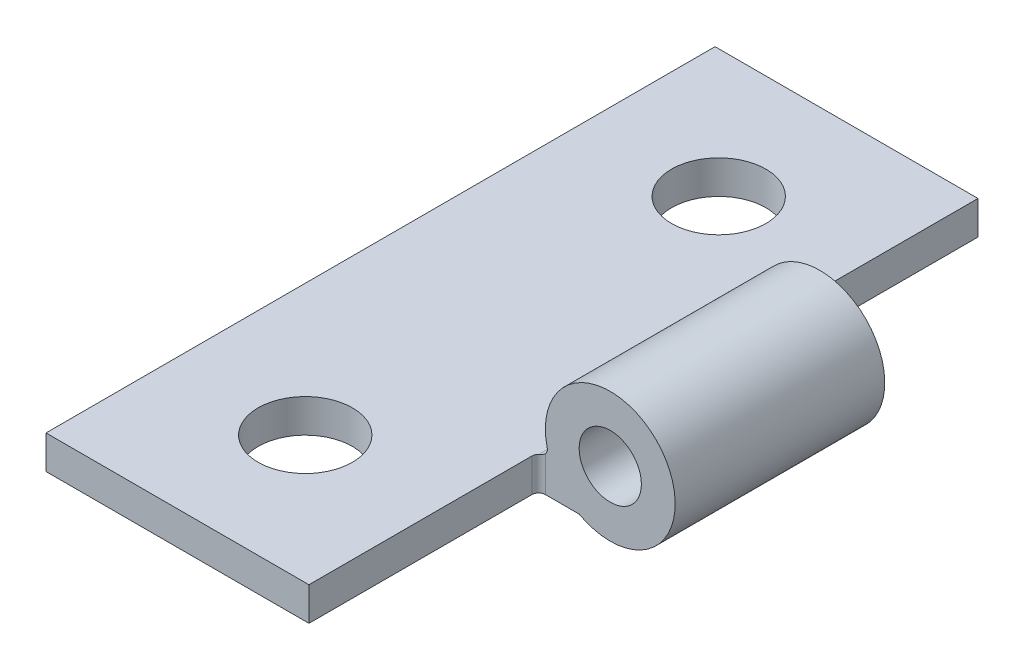
ISO-10303-21;
HEADER;
FILE_DESCRIPTION(('STEP AP214'),'2;1');
FILE_NAME('part.step','',(''),(''),'','','');
FILE_SCHEMA(('AUTOMOTIVE_DESIGN { 1 0 10303 214 1 1 1 1 }'));
ENDSEC;
DATA;
#1=APPLICATION_CONTEXT('core data for automotive mechanical design processes');
#2=APPLICATION_PROTOCOL_DEFINITION('international standard','automotive_design',2000,#1);
#3=PRODUCT_CONTEXT('',#1,'mechanical');
#4=PRODUCT('Part','Part','',(#3));
#5=PRODUCT_RELATED_PRODUCT_CATEGORY('part','',(#4));
#6=PRODUCT_DEFINITION_FORMATION('','',#4);
#7=PRODUCT_DEFINITION_CONTEXT('part definition',#1,'design');
#8=PRODUCT_DEFINITION('design','',#6,#7);
#9=PRODUCT_DEFINITION_SHAPE('','',#8);
#10=(LENGTH_UNIT() NAMED_UNIT(*) SI_UNIT(.MILLI.,.METRE.));
#11=(NAMED_UNIT(*) PLANE_ANGLE_UNIT() SI_UNIT($,.RADIAN.));
#12=(NAMED_UNIT(*) SI_UNIT($,.STERADIAN.) SOLID_ANGLE_UNIT());
#13=UNCERTAINTY_MEASURE_WITH_UNIT(LENGTH_MEASURE(1.E-05),#10,'distance_accuracy_value','');
#14=(GEOMETRIC_REPRESENTATION_CONTEXT(3) GLOBAL_UNCERTAINTY_ASSIGNED_CONTEXT((#13)) GLOBAL_UNIT_ASSIGNED_CONTEXT((#10,
#11,#12)) REPRESENTATION_CONTEXT('',''));
#15=CARTESIAN_POINT('',(0.,0.,0.));
#16=DIRECTION('',(0.,0.,1.));
#17=DIRECTION('',(1.,0.,0.));
#18=AXIS2_PLACEMENT_3D('',#15,#16,#17);
#19=CARTESIAN_POINT('',(-7.56939432776208,4.1385763680781,25.4));
#20=DIRECTION('',(0.,0.,-1.));
#21=DIRECTION('',(-1.,0.,0.));
#22=AXIS2_PLACEMENT_3D('',#19,#20,#21);
#23=CYLINDRICAL_SURFACE('',#22,0.254);
#24=DIRECTION('',(0.,0.,1.));
#25=VECTOR('',#24,1.);
#26=CARTESIAN_POINT('',(-7.56939432776208,3.8845763680781,0.));
#27=LINE('',#26,#25);
#28=CARTESIAN_POINT('',(-7.56939432776208,3.8845763680781,16.7517084015398));
#29=VERTEX_POINT('',#28);
#30=CARTESIAN_POINT('',(-7.56939432776208,3.8845763680781,8.64829159846018));
#31=VERTEX_POINT('',#30);
#32=EDGE_CURVE('E60',#29,#31,#27,.F.);
#33=ORIENTED_EDGE('',*,*,#32,.F.);
#34=CARTESIAN_POINT('',(-7.56939432776208,3.8845763680781,16.7517084015398));
#35=CARTESIAN_POINT('',(-7.56135668745851,3.88456692801648,16.7437883049521));
#36=CARTESIAN_POINT('',(-7.55275337596611,3.88495780348265,16.7364149583661));
#37=CARTESIAN_POINT('',(-7.53471275338375,3.88679410637373,16.7229046807157));
#38=CARTESIAN_POINT('',(-7.52527433420336,3.88824095396449,16.7167694289506));
#39=CARTESIAN_POINT('',(-7.50584259238112,3.89245352537904,16.705877117358));
#40=CARTESIAN_POINT('',(-7.49584706377318,3.89522487817183,16.7011260802788));
#41=CARTESIAN_POINT('',(-7.47579100856352,3.90221473178685,16.6930964397848));
#42=CARTESIAN_POINT('',(-7.46573061286791,3.90643089027619,16.6898154728223));
#43=CARTESIAN_POINT('',(-7.44652207839989,3.91602875812045,16.6847751638258));
#44=CARTESIAN_POINT('',(-7.43735426580634,3.92133305093389,16.6829416610186));
#45=CARTESIAN_POINT('',(-7.41966059402174,3.93312886665447,16.6803286849135));
#46=CARTESIAN_POINT('',(-7.41113465987094,3.93962025062638,16.6795490883577));
#47=CARTESIAN_POINT('',(-7.39905284901864,3.95008730971583,16.6789935002285));
#48=CARTESIAN_POINT('',(-7.39516602610554,3.95367284553677,16.6789092332638));
#49=CARTESIAN_POINT('',(-7.3914,3.95737476961791,16.67891));
#50=B_SPLINE_CURVE_WITH_KNOTS('',3,(#34,#35,#36,#37,#38,#39,#40,#41,#42,#43,#44,#45,#46,#47,#48,
#49),.UNSPECIFIED.,.F.,.F.,(4,2,2,2,2,2,2,4),(0.,0.0338498974036393,0.0677454032647584,
0.101786259043816,0.135772186520257,0.16787727227293,0.19997860290024,0.215828269392702),.UNSPECIFIED.);
#51=CARTESIAN_POINT('',(-7.3914,3.95737476961791,16.67891));
#52=VERTEX_POINT('',#51);
#53=EDGE_CURVE('E208',#29,#52,#50,.T.);
#54=ORIENTED_EDGE('',*,*,#53,.T.);
#55=CARTESIAN_POINT('',(-7.56939432776208,4.1385763680781,16.67891));
#56=DIRECTION('',(0.,0.,-1.));
#57=DIRECTION('',(-1.,0.,0.));
#58=AXIS2_PLACEMENT_3D('',#55,#56,#57);
#59=CIRCLE('',#58,0.254);
#60=CARTESIAN_POINT('',(-7.32249766161609,4.19822564507284,16.67891));
#61=VERTEX_POINT('',#60);
#62=EDGE_CURVE('E136',#52,#61,#59,.F.);
#63=ORIENTED_EDGE('',*,*,#62,.T.);
#64=DIRECTION('',(0.,0.,-1.));
#65=VECTOR('',#64,1.);
#66=CARTESIAN_POINT('',(-7.32249766161609,4.19822564507284,25.4));
#67=LINE('',#66,#65);
#68=CARTESIAN_POINT('',(-7.32249766161609,4.19822564507284,8.72109));
#69=VERTEX_POINT('',#68);
#70=EDGE_CURVE('E187',#69,#61,#67,.F.);
#71=ORIENTED_EDGE('',*,*,#70,.F.);
#72=CARTESIAN_POINT('',(-7.56939432776208,4.1385763680781,8.72109));
#73=DIRECTION('',(0.,0.,-1.));
#74=DIRECTION('',(-1.,0.,0.));
#75=AXIS2_PLACEMENT_3D('',#72,#73,#74);
#76=CIRCLE('',#75,0.254);
#77=CARTESIAN_POINT('',(-7.3914,3.95737476961791,8.72109));
#78=VERTEX_POINT('',#77);
#79=EDGE_CURVE('E273',#78,#69,#76,.F.);
#80=ORIENTED_EDGE('',*,*,#79,.F.);
#81=CARTESIAN_POINT('',(-7.3914,3.95737476961791,8.72109));
#82=CARTESIAN_POINT('',(-7.39943764030357,3.94945467303018,8.72109944006161));
#83=CARTESIAN_POINT('',(-7.40804095179597,3.9420813264442,8.72070856459545));
#84=CARTESIAN_POINT('',(-7.42608157437833,3.92857104879381,8.71887226170437));
#85=CARTESIAN_POINT('',(-7.43551999355872,3.92243579702871,8.7174254141136));
#86=CARTESIAN_POINT('',(-7.45495173538096,3.91154348543606,8.71321284269906));
#87=CARTESIAN_POINT('',(-7.4649472639889,3.90679244835687,8.71044148990626));
#88=CARTESIAN_POINT('',(-7.48500331919856,3.89876280786291,8.70345163629124));
#89=CARTESIAN_POINT('',(-7.49506371489417,3.89548184090043,8.6992354778019));
#90=CARTESIAN_POINT('',(-7.51427224936219,3.89044153190394,8.68963760995764));
#91=CARTESIAN_POINT('',(-7.52344006195574,3.88860802909672,8.6843333171442));
#92=CARTESIAN_POINT('',(-7.54113373374034,3.88599505299161,8.67253750142362));
#93=CARTESIAN_POINT('',(-7.54965966789114,3.88521545643575,8.66604611745171));
#94=CARTESIAN_POINT('',(-7.56174147874344,3.88465986830663,8.65557905836226));
#95=CARTESIAN_POINT('',(-7.56562830165654,3.88457560134187,8.65199352254132));
#96=CARTESIAN_POINT('',(-7.56939432776208,3.8845763680781,8.64829159846018));
#97=B_SPLINE_CURVE_WITH_KNOTS('',3,(#81,#82,#83,#84,#85,#86,#87,#88,#89,#90,#91,#92,#93,#94,#95,
#96),.UNSPECIFIED.,.F.,.F.,(4,2,2,2,2,2,2,4),(0.,0.0338498974036388,0.0677454032647585,
0.101786259043815,0.135772186520258,0.16787727227293,0.199978602900239,0.215828269392703),.UNSPECIFIED.);
#98=EDGE_CURVE('E245',#78,#31,#97,.T.);
#99=ORIENTED_EDGE('',*,*,#98,.T.);
#100=EDGE_LOOP('',(#33,#54,#63,#71,#80,#99));
#101=FACE_BOUND('',#100,.T.);
#102=ADVANCED_FACE('F43',(#101),#23,.F.);
#103=CARTESIAN_POINT('',(-4.9276,4.7768236319219,25.4));
#104=DIRECTION('',(0.,0.,-1.));
#105=DIRECTION('',(-1.,0.,0.));
#106=AXIS2_PLACEMENT_3D('',#103,#104,#105);
#107=CYLINDRICAL_SURFACE('',#106,2.4638);
#108=CARTESIAN_POINT('',(-4.9276,4.7768236319219,16.67891));
#109=DIRECTION('',(0.,0.,1.));
#110=DIRECTION('',(1.,0.,0.));
#111=AXIS2_PLACEMENT_3D('',#108,#109,#110);
#112=CIRCLE('',#111,2.4638);
#113=CARTESIAN_POINT('',(-6.1087,2.6145763680781,16.67891));
#114=VERTEX_POINT('',#113);
#115=EDGE_CURVE('E276',#114,#61,#112,.T.);
#116=ORIENTED_EDGE('',*,*,#115,.F.);
#117=DIRECTION('',(0.,0.,-1.));
#118=VECTOR('',#117,1.);
#119=CARTESIAN_POINT('',(-6.1087,2.6145763680781,25.4));
#120=LINE('',#119,#118);
#121=CARTESIAN_POINT('',(-6.1087,2.6145763680781,8.72109));
#122=VERTEX_POINT('',#121);
#123=EDGE_CURVE('E181',#114,#122,#120,.T.);
#124=ORIENTED_EDGE('',*,*,#123,.T.);
#125=CARTESIAN_POINT('',(-4.9276,4.7768236319219,8.72109));
#126=DIRECTION('',(0.,0.,-1.));
#127=DIRECTION('',(-1.,0.,0.));
#128=AXIS2_PLACEMENT_3D('',#125,#126,#127);
#129=CIRCLE('',#128,2.4638);
#130=EDGE_CURVE('E282',#69,#122,#129,.T.);
#131=ORIENTED_EDGE('',*,*,#130,.F.);
#132=ORIENTED_EDGE('',*,*,#70,.T.);
#133=EDGE_LOOP('',(#116,#124,#131,#132));
#134=FACE_BOUND('',#133,.T.);
#135=ADVANCED_FACE('F234',(#134),#107,.T.);
#136=CARTESIAN_POINT('',(-4.9276,4.7768236319219,25.4));
#137=DIRECTION('',(0.,0.,-1.));
#138=DIRECTION('',(-1.,0.,0.));
#139=AXIS2_PLACEMENT_3D('',#136,#137,#138);
#140=CYLINDRICAL_SURFACE('',#139,1.1811);
#141=CARTESIAN_POINT('',(-4.9276,4.7768236319219,8.72109));
#142=DIRECTION('',(0.,0.,-1.));
#143=DIRECTION('',(-1.,0.,0.));
#144=AXIS2_PLACEMENT_3D('',#141,#142,#143);
#145=CIRCLE('',#144,1.1811);
#146=CARTESIAN_POINT('',(-6.1087,4.7768236319219,8.72109));
#147=VERTEX_POINT('',#146);
#148=EDGE_CURVE('E163',#147,#147,#145,.T.);
#149=ORIENTED_EDGE('',*,*,#148,.T.);
#150=EDGE_LOOP('',(#149));
#151=FACE_BOUND('',#150,.T.);
#152=CARTESIAN_POINT('',(-4.9276,4.7768236319219,16.67891));
#153=DIRECTION('',(0.,0.,1.));
#154=DIRECTION('',(1.,0.,0.));
#155=AXIS2_PLACEMENT_3D('',#152,#153,#154);
#156=CIRCLE('',#155,1.1811);
#157=CARTESIAN_POINT('',(-3.7465,4.7768236319219,16.67891));
#158=VERTEX_POINT('',#157);
#159=EDGE_CURVE('E279',#158,#158,#156,.T.);
#160=ORIENTED_EDGE('',*,*,#159,.T.);
#161=EDGE_LOOP('',(#160));
#162=FACE_BOUND('',#161,.T.);
#163=ADVANCED_FACE('F239',(#151,#162),#140,.F.);
#164=CARTESIAN_POINT('',(-4.9276,4.7768236319219,25.4));
#165=DIRECTION('',(0.,0.,1.));
#166=DIRECTION('',(1.,0.,0.));
#167=AXIS2_PLACEMENT_3D('',#164,#165,#166);
#168=PLANE('',#167);
#169=DIRECTION('',(0.,-1.,0.));
#170=VECTOR('',#169,1.);
#171=CARTESIAN_POINT('',(-7.6454,2.61457636807809,25.4));
#172=LINE('',#171,#170);
#173=CARTESIAN_POINT('',(-7.6454,3.8845763680781,25.4));
#174=VERTEX_POINT('',#173);
#175=CARTESIAN_POINT('',(-7.6454,2.61457636807809,25.4));
#176=VERTEX_POINT('',#175);
#177=EDGE_CURVE('E140',#174,#176,#172,.T.);
#178=ORIENTED_EDGE('',*,*,#177,.F.);
#179=DIRECTION('',(-1.,0.,0.));
#180=VECTOR('',#179,1.);
#181=CARTESIAN_POINT('',(-17.6276,3.88457636807809,25.4));
#182=LINE('',#181,#180);
#183=CARTESIAN_POINT('',(-17.6276,3.88457636807809,25.4));
#184=VERTEX_POINT('',#183);
#185=EDGE_CURVE('E154',#174,#184,#182,.T.);
#186=ORIENTED_EDGE('',*,*,#185,.T.);
#187=DIRECTION('',(0.,-1.,0.));
#188=VECTOR('',#187,1.);
#189=CARTESIAN_POINT('',(-17.6276,2.61457636807809,25.4));
#190=LINE('',#189,#188);
#191=CARTESIAN_POINT('',(-17.6276,2.61457636807809,25.4));
#192=VERTEX_POINT('',#191);
#193=EDGE_CURVE('E151',#184,#192,#190,.T.);
#194=ORIENTED_EDGE('',*,*,#193,.T.);
#195=DIRECTION('',(1.,0.,0.));
#196=VECTOR('',#195,1.);
#197=CARTESIAN_POINT('',(-17.6276,2.61457636807809,25.4));
#198=LINE('',#197,#196);
#199=EDGE_CURVE('E131',#192,#176,#198,.T.);
#200=ORIENTED_EDGE('',*,*,#199,.T.);
#201=EDGE_LOOP('',(#178,#186,#194,#200));
#202=FACE_BOUND('',#201,.T.);
#203=ADVANCED_FACE('F149',(#202),#168,.T.);
#204=CARTESIAN_POINT('',(-4.9276,4.7768236319219,0.));
#205=DIRECTION('',(0.,0.,1.));
#206=DIRECTION('',(1.,0.,0.));
#207=AXIS2_PLACEMENT_3D('',#204,#205,#206);
#208=PLANE('',#207);
#209=DIRECTION('',(-1.,0.,0.));
#210=VECTOR('',#209,1.);
#211=CARTESIAN_POINT('',(-17.6276,3.88457636807809,0.));
#212=LINE('',#211,#210);
#213=CARTESIAN_POINT('',(-7.6454,3.8845763680781,0.));
#214=VERTEX_POINT('',#213);
#215=CARTESIAN_POINT('',(-17.6276,3.88457636807809,0.));
#216=VERTEX_POINT('',#215);
#217=EDGE_CURVE('E160',#214,#216,#212,.T.);
#218=ORIENTED_EDGE('',*,*,#217,.F.);
#219=DIRECTION('',(0.,1.,0.));
#220=VECTOR('',#219,1.);
#221=CARTESIAN_POINT('',(-7.6454,2.61457636807809,0.));
#222=LINE('',#221,#220);
#223=CARTESIAN_POINT('',(-7.6454,2.61457636807809,0.));
#224=VERTEX_POINT('',#223);
#225=EDGE_CURVE('E262',#224,#214,#222,.T.);
#226=ORIENTED_EDGE('',*,*,#225,.F.);
#227=DIRECTION('',(1.,0.,0.));
#228=VECTOR('',#227,1.);
#229=CARTESIAN_POINT('',(-17.6276,2.61457636807809,0.));
#230=LINE('',#229,#228);
#231=CARTESIAN_POINT('',(-17.6276,2.61457636807809,0.));
#232=VERTEX_POINT('',#231);
#233=EDGE_CURVE('E169',#232,#224,#230,.T.);
#234=ORIENTED_EDGE('',*,*,#233,.F.);
#235=DIRECTION('',(0.,-1.,0.));
#236=VECTOR('',#235,1.);
#237=CARTESIAN_POINT('',(-17.6276,2.61457636807809,0.));
#238=LINE('',#237,#236);
#239=EDGE_CURVE('E155',#216,#232,#238,.T.);
#240=ORIENTED_EDGE('',*,*,#239,.F.);
#241=EDGE_LOOP('',(#218,#226,#234,#240));
#242=FACE_BOUND('',#241,.T.);
#243=ADVANCED_FACE('F309',(#242),#208,.F.);
#244=CARTESIAN_POINT('',(-17.6276,2.61457636807809,25.4));
#245=DIRECTION('',(0.,1.,0.));
#246=DIRECTION('',(-1.,0.,0.));
#247=AXIS2_PLACEMENT_3D('',#244,#245,#246);
#248=PLANE('',#247);
#249=CARTESIAN_POINT('',(-12.6365,2.61457636807809,4.8514));
#250=DIRECTION('',(0.,1.,0.));
#251=DIRECTION('',(-1.,0.,0.));
#252=AXIS2_PLACEMENT_3D('',#249,#250,#251);
#253=CIRCLE('',#252,1.7907);
#254=CARTESIAN_POINT('',(-14.4272,2.61457636807809,4.8514));
#255=VERTEX_POINT('',#254);
#256=EDGE_CURVE('E147',#255,#255,#253,.T.);
#257=ORIENTED_EDGE('',*,*,#256,.T.);
#258=EDGE_LOOP('',(#257));
#259=FACE_BOUND('',#258,.T.);
#260=CARTESIAN_POINT('',(-12.6365,2.61457636807809,20.5486));
#261=DIRECTION('',(0.,1.,0.));
#262=DIRECTION('',(-1.,0.,0.));
#263=AXIS2_PLACEMENT_3D('',#260,#261,#262);
#264=CIRCLE('',#263,1.7907);
#265=CARTESIAN_POINT('',(-14.4272,2.61457636807809,20.5486));
#266=VERTEX_POINT('',#265);
#267=EDGE_CURVE('E324',#266,#266,#264,.T.);
#268=ORIENTED_EDGE('',*,*,#267,.T.);
#269=EDGE_LOOP('',(#268));
#270=FACE_BOUND('',#269,.T.);
#271=DIRECTION('',(1.,0.,0.));
#272=VECTOR('',#271,1.);
#273=CARTESIAN_POINT('',(-7.6454,2.61457636807809,16.67891));
#274=LINE('',#273,#272);
#275=CARTESIAN_POINT('',(-7.3914,2.61457636807809,16.67891));
#276=VERTEX_POINT('',#275);
#277=EDGE_CURVE('E137',#276,#114,#274,.T.);
#278=ORIENTED_EDGE('',*,*,#277,.F.);
#279=CARTESIAN_POINT('',(-7.3914,2.6145763680781,16.93291));
#280=DIRECTION('',(0.,1.,0.));
#281=DIRECTION('',(-1.,0.,0.));
#282=AXIS2_PLACEMENT_3D('',#279,#280,#281);
#283=CIRCLE('',#282,0.254);
#284=CARTESIAN_POINT('',(-7.6454,2.61457636807809,16.93291));
#285=VERTEX_POINT('',#284);
#286=EDGE_CURVE('E132',#276,#285,#283,.T.);
#287=ORIENTED_EDGE('',*,*,#286,.T.);
#288=DIRECTION('',(0.,0.,1.));
#289=VECTOR('',#288,1.);
#290=CARTESIAN_POINT('',(-7.6454,2.61457636807809,16.67891));
#291=LINE('',#290,#289);
#292=EDGE_CURVE('E125',#285,#176,#291,.T.);
#293=ORIENTED_EDGE('',*,*,#292,.T.);
#294=ORIENTED_EDGE('',*,*,#199,.F.);
#295=DIRECTION('',(0.,0.,-1.));
#296=VECTOR('',#295,1.);
#297=CARTESIAN_POINT('',(-17.6276,2.61457636807809,25.4));
#298=LINE('',#297,#296);
#299=EDGE_CURVE('E168',#192,#232,#298,.T.);
#300=ORIENTED_EDGE('',*,*,#299,.T.);
#301=ORIENTED_EDGE('',*,*,#233,.T.);
#302=DIRECTION('',(0.,0.,-1.));
#303=VECTOR('',#302,1.);
#304=CARTESIAN_POINT('',(-7.6454,2.61457636807809,8.72109));
#305=LINE('',#304,#303);
#306=CARTESIAN_POINT('',(-7.6454,2.61457636807809,8.46709));
#307=VERTEX_POINT('',#306);
#308=EDGE_CURVE('E267',#307,#224,#305,.T.);
#309=ORIENTED_EDGE('',*,*,#308,.F.);
#310=CARTESIAN_POINT('',(-7.3914,2.6145763680781,8.46709));
#311=DIRECTION('',(0.,1.,0.));
#312=DIRECTION('',(-1.,0.,0.));
#313=AXIS2_PLACEMENT_3D('',#310,#311,#312);
#314=CIRCLE('',#313,0.254);
#315=CARTESIAN_POINT('',(-7.3914,2.61457636807809,8.72109));
#316=VERTEX_POINT('',#315);
#317=EDGE_CURVE('E11',#307,#316,#314,.T.);
#318=ORIENTED_EDGE('',*,*,#317,.T.);
#319=DIRECTION('',(-1.,0.,0.));
#320=VECTOR('',#319,1.);
#321=CARTESIAN_POINT('',(-7.6454,2.61457636807809,8.72109));
#322=LINE('',#321,#320);
#323=EDGE_CURVE('E263',#122,#316,#322,.T.);
#324=ORIENTED_EDGE('',*,*,#323,.F.);
#325=ORIENTED_EDGE('',*,*,#123,.F.);
#326=EDGE_LOOP('',(#278,#287,#293,#294,#300,#301,#309,#318,#324,#325));
#327=FACE_BOUND('',#326,.T.);
#328=ADVANCED_FACE('F128',(#259,#270,#327),#248,.F.);
#329=CARTESIAN_POINT('',(-17.6276,3.88457636807809,25.4));
#330=DIRECTION('',(0.,-1.,0.));
#331=DIRECTION('',(1.,0.,0.));
#332=AXIS2_PLACEMENT_3D('',#329,#330,#331);
#333=PLANE('',#332);
#334=CARTESIAN_POINT('',(-12.6365,3.88457636807809,4.8514));
#335=DIRECTION('',(0.,1.,0.));
#336=DIRECTION('',(-1.,0.,0.));
#337=AXIS2_PLACEMENT_3D('',#334,#335,#336);
#338=CIRCLE('',#337,1.7907);
#339=CARTESIAN_POINT('',(-14.4272,3.88457636807809,4.8514));
#340=VERTEX_POINT('',#339);
#341=EDGE_CURVE('E327',#340,#340,#338,.T.);
#342=ORIENTED_EDGE('',*,*,#341,.F.);
#343=EDGE_LOOP('',(#342));
#344=FACE_BOUND('',#343,.T.);
#345=CARTESIAN_POINT('',(-12.6365,3.88457636807809,20.5486));
#346=DIRECTION('',(0.,1.,0.));
#347=DIRECTION('',(-1.,0.,0.));
#348=AXIS2_PLACEMENT_3D('',#345,#346,#347);
#349=CIRCLE('',#348,1.7907);
#350=CARTESIAN_POINT('',(-14.4272,3.88457636807809,20.5486));
#351=VERTEX_POINT('',#350);
#352=EDGE_CURVE('E331',#351,#351,#349,.T.);
#353=ORIENTED_EDGE('',*,*,#352,.F.);
#354=EDGE_LOOP('',(#353));
#355=FACE_BOUND('',#354,.T.);
#356=ORIENTED_EDGE('',*,*,#185,.F.);
#357=DIRECTION('',(0.,0.,-1.));
#358=VECTOR('',#357,1.);
#359=CARTESIAN_POINT('',(-7.6454,3.8845763680781,25.4));
#360=LINE('',#359,#358);
#361=CARTESIAN_POINT('',(-7.6454,3.8845763680781,16.93291));
#362=VERTEX_POINT('',#361);
#363=EDGE_CURVE('E143',#174,#362,#360,.T.);
#364=ORIENTED_EDGE('',*,*,#363,.T.);
#365=CARTESIAN_POINT('',(-7.3914,3.8845763680781,16.93291));
#366=DIRECTION('',(0.,-1.,0.));
#367=DIRECTION('',(1.,0.,0.));
#368=AXIS2_PLACEMENT_3D('',#365,#366,#367);
#369=CIRCLE('',#368,0.254);
#370=EDGE_CURVE('E205',#362,#29,#369,.T.);
#371=ORIENTED_EDGE('',*,*,#370,.T.);
#372=ORIENTED_EDGE('',*,*,#32,.T.);
#373=CARTESIAN_POINT('',(-7.3914,3.8845763680781,8.46709));
#374=DIRECTION('',(0.,-1.,0.));
#375=DIRECTION('',(1.,0.,0.));
#376=AXIS2_PLACEMENT_3D('',#373,#374,#375);
#377=CIRCLE('',#376,0.254);
#378=CARTESIAN_POINT('',(-7.6454,3.8845763680781,8.46709));
#379=VERTEX_POINT('',#378);
#380=EDGE_CURVE('E53',#31,#379,#377,.T.);
#381=ORIENTED_EDGE('',*,*,#380,.T.);
#382=DIRECTION('',(0.,0.,-1.));
#383=VECTOR('',#382,1.);
#384=CARTESIAN_POINT('',(-7.6454,3.8845763680781,25.4));
#385=LINE('',#384,#383);
#386=EDGE_CURVE('E191',#379,#214,#385,.T.);
#387=ORIENTED_EDGE('',*,*,#386,.T.);
#388=ORIENTED_EDGE('',*,*,#217,.T.);
#389=DIRECTION('',(0.,0.,-1.));
#390=VECTOR('',#389,1.);
#391=CARTESIAN_POINT('',(-17.6276,3.88457636807809,25.4));
#392=LINE('',#391,#390);
#393=EDGE_CURVE('E177',#184,#216,#392,.T.);
#394=ORIENTED_EDGE('',*,*,#393,.F.);
#395=EDGE_LOOP('',(#356,#364,#371,#372,#381,#387,#388,#394));
#396=FACE_BOUND('',#395,.T.);
#397=ADVANCED_FACE('F246',(#344,#355,#396),#333,.F.);
#398=CARTESIAN_POINT('',(-17.6276,2.61457636807809,25.4));
#399=DIRECTION('',(1.,0.,0.));
#400=DIRECTION('',(0.,0.,-1.));
#401=AXIS2_PLACEMENT_3D('',#398,#399,#400);
#402=PLANE('',#401);
#403=ORIENTED_EDGE('',*,*,#239,.T.);
#404=ORIENTED_EDGE('',*,*,#299,.F.);
#405=ORIENTED_EDGE('',*,*,#193,.F.);
#406=ORIENTED_EDGE('',*,*,#393,.T.);
#407=EDGE_LOOP('',(#403,#404,#405,#406));
#408=FACE_BOUND('',#407,.T.);
#409=ADVANCED_FACE('F294',(#408),#402,.F.);
#410=CARTESIAN_POINT('',(-4.9276,4.7768236319219,8.72109));
#411=DIRECTION('',(0.,0.,-1.));
#412=DIRECTION('',(-1.,0.,0.));
#413=AXIS2_PLACEMENT_3D('',#410,#411,#412);
#414=PLANE('',#413);
#415=ORIENTED_EDGE('',*,*,#323,.T.);
#416=DIRECTION('',(0.,1.,0.));
#417=VECTOR('',#416,1.);
#418=CARTESIAN_POINT('',(-7.3914,4.7768236319219,8.72109));
#419=LINE('',#418,#417);
#420=EDGE_CURVE('E216',#316,#78,#419,.T.);
#421=ORIENTED_EDGE('',*,*,#420,.T.);
#422=ORIENTED_EDGE('',*,*,#79,.T.);
#423=ORIENTED_EDGE('',*,*,#130,.T.);
#424=EDGE_LOOP('',(#415,#421,#422,#423));
#425=FACE_BOUND('',#424,.T.);
#426=ORIENTED_EDGE('',*,*,#148,.F.);
#427=EDGE_LOOP('',(#426));
#428=FACE_BOUND('',#427,.T.);
#429=ADVANCED_FACE('F292',(#425,#428),#414,.T.);
#430=CARTESIAN_POINT('',(-4.9276,4.7768236319219,16.67891));
#431=DIRECTION('',(0.,0.,1.));
#432=DIRECTION('',(1.,0.,0.));
#433=AXIS2_PLACEMENT_3D('',#430,#431,#432);
#434=PLANE('',#433);
#435=ORIENTED_EDGE('',*,*,#62,.F.);
#436=DIRECTION('',(0.,-1.,0.));
#437=VECTOR('',#436,1.);
#438=CARTESIAN_POINT('',(-7.3914,4.7768236319219,16.67891));
#439=LINE('',#438,#437);
#440=EDGE_CURVE('E196',#52,#276,#439,.T.);
#441=ORIENTED_EDGE('',*,*,#440,.T.);
#442=ORIENTED_EDGE('',*,*,#277,.T.);
#443=ORIENTED_EDGE('',*,*,#115,.T.);
#444=EDGE_LOOP('',(#435,#441,#442,#443));
#445=FACE_BOUND('',#444,.T.);
#446=ORIENTED_EDGE('',*,*,#159,.F.);
#447=EDGE_LOOP('',(#446));
#448=FACE_BOUND('',#447,.T.);
#449=ADVANCED_FACE('F249',(#445,#448),#434,.T.);
#450=CARTESIAN_POINT('',(-7.6454,2.61457636807809,8.72109));
#451=DIRECTION('',(-1.,0.,0.));
#452=DIRECTION('',(0.,-1.,0.));
#453=AXIS2_PLACEMENT_3D('',#450,#451,#452);
#454=PLANE('',#453);
#455=ORIENTED_EDGE('',*,*,#386,.F.);
#456=DIRECTION('',(0.,1.,0.));
#457=VECTOR('',#456,1.);
#458=CARTESIAN_POINT('',(-7.6454,2.61457636807809,8.46709));
#459=LINE('',#458,#457);
#460=EDGE_CURVE('E352',#379,#307,#459,.F.);
#461=ORIENTED_EDGE('',*,*,#460,.T.);
#462=ORIENTED_EDGE('',*,*,#308,.T.);
#463=ORIENTED_EDGE('',*,*,#225,.T.);
#464=EDGE_LOOP('',(#455,#461,#462,#463));
#465=FACE_BOUND('',#464,.T.);
#466=ADVANCED_FACE('F230',(#465),#454,.F.);
#467=CARTESIAN_POINT('',(-7.6454,2.61457636807809,16.67891));
#468=DIRECTION('',(-1.,0.,0.));
#469=DIRECTION('',(0.,0.,1.));
#470=AXIS2_PLACEMENT_3D('',#467,#468,#469);
#471=PLANE('',#470);
#472=ORIENTED_EDGE('',*,*,#292,.F.);
#473=DIRECTION('',(0.,-1.,0.));
#474=VECTOR('',#473,1.);
#475=CARTESIAN_POINT('',(-7.6454,2.61457636807809,16.93291));
#476=LINE('',#475,#474);
#477=EDGE_CURVE('E200',#285,#362,#476,.F.);
#478=ORIENTED_EDGE('',*,*,#477,.T.);
#479=ORIENTED_EDGE('',*,*,#363,.F.);
#480=ORIENTED_EDGE('',*,*,#177,.T.);
#481=EDGE_LOOP('',(#472,#478,#479,#480));
#482=FACE_BOUND('',#481,.T.);
#483=ADVANCED_FACE('F141',(#482),#471,.F.);
#484=CARTESIAN_POINT('',(-7.3914,4.7768236319219,16.93291));
#485=DIRECTION('',(0.,-1.,0.));
#486=DIRECTION('',(0.,0.,-1.));
#487=AXIS2_PLACEMENT_3D('',#484,#485,#486);
#488=CYLINDRICAL_SURFACE('',#487,0.254);
#489=ORIENTED_EDGE('',*,*,#370,.F.);
#490=ORIENTED_EDGE('',*,*,#477,.F.);
#491=ORIENTED_EDGE('',*,*,#286,.F.);
#492=ORIENTED_EDGE('',*,*,#440,.F.);
#493=ORIENTED_EDGE('',*,*,#53,.F.);
#494=EDGE_LOOP('',(#489,#490,#491,#492,#493));
#495=FACE_BOUND('',#494,.T.);
#496=ADVANCED_FACE('F220',(#495),#488,.F.);
#497=CARTESIAN_POINT('',(-7.3914,4.7768236319219,8.46709));
#498=DIRECTION('',(0.,1.,0.));
#499=DIRECTION('',(-1.,0.,0.));
#500=AXIS2_PLACEMENT_3D('',#497,#498,#499);
#501=CYLINDRICAL_SURFACE('',#500,0.254);
#502=ORIENTED_EDGE('',*,*,#317,.F.);
#503=ORIENTED_EDGE('',*,*,#460,.F.);
#504=ORIENTED_EDGE('',*,*,#380,.F.);
#505=ORIENTED_EDGE('',*,*,#98,.F.);
#506=ORIENTED_EDGE('',*,*,#420,.F.);
#507=EDGE_LOOP('',(#502,#503,#504,#505,#506));
#508=FACE_BOUND('',#507,.T.);
#509=ADVANCED_FACE('F45',(#508),#501,.F.);
#510=CARTESIAN_POINT('',(-12.6365,1.34457636807809,20.5486));
#511=DIRECTION('',(0.,1.,0.));
#512=DIRECTION('',(-1.,0.,0.));
#513=AXIS2_PLACEMENT_3D('',#510,#511,#512);
#514=CYLINDRICAL_SURFACE('',#513,1.7907);
#515=ORIENTED_EDGE('',*,*,#352,.T.);
#516=EDGE_LOOP('',(#515));
#517=FACE_BOUND('',#516,.T.);
#518=ORIENTED_EDGE('',*,*,#267,.F.);
#519=EDGE_LOOP('',(#518));
#520=FACE_BOUND('',#519,.T.);
#521=ADVANCED_FACE('F228',(#517,#520),#514,.F.);
#522=CARTESIAN_POINT('',(-12.6365,1.34457636807809,4.8514));
#523=DIRECTION('',(0.,1.,0.));
#524=DIRECTION('',(-1.,0.,0.));
#525=AXIS2_PLACEMENT_3D('',#522,#523,#524);
#526=CYLINDRICAL_SURFACE('',#525,1.7907);
#527=ORIENTED_EDGE('',*,*,#341,.T.);
#528=EDGE_LOOP('',(#527));
#529=FACE_BOUND('',#528,.T.);
#530=ORIENTED_EDGE('',*,*,#256,.F.);
#531=EDGE_LOOP('',(#530));
#532=FACE_BOUND('',#531,.T.);
#533=ADVANCED_FACE('F340',(#529,#532),#526,.F.);
#534=CLOSED_SHELL('',(#102,#135,#163,#203,#243,#328,#397,#409,#429,#449,#466,#483,#496,#509,
#521,#533));
#535=MANIFOLD_SOLID_BREP('B2',#534);
#536=ADVANCED_BREP_SHAPE_REPRESENTATION('',(#18,#535),#14);
#537=SHAPE_DEFINITION_REPRESENTATION(#9,#536);
ENDSEC;
END-ISO-10303-21;
